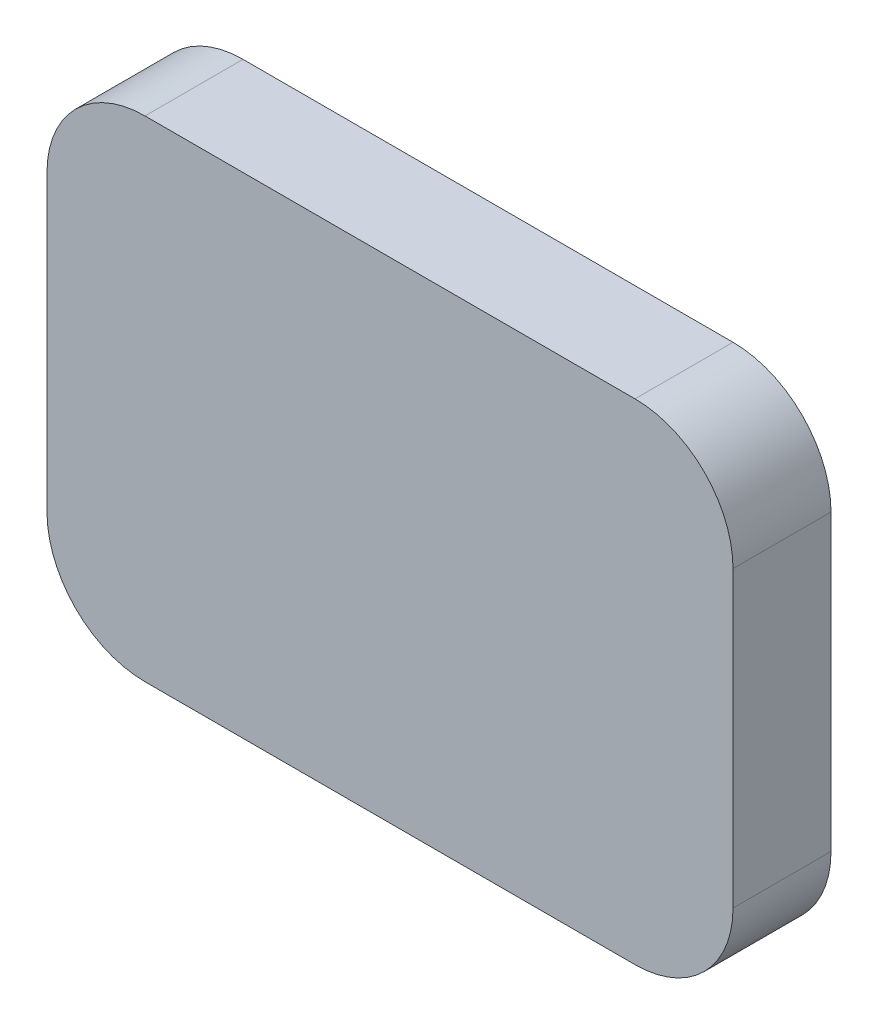
ISO-10303-21;
HEADER;
FILE_DESCRIPTION(('STEP AP214'),'2;1');
FILE_NAME('part.step','',(''),(''),'','','');
FILE_SCHEMA(('AUTOMOTIVE_DESIGN { 1 0 10303 214 1 1 1 1 }'));
ENDSEC;
DATA;
#1=APPLICATION_CONTEXT('core data for automotive mechanical design processes');
#2=APPLICATION_PROTOCOL_DEFINITION('international standard','automotive_design',2000,#1);
#3=PRODUCT_CONTEXT('',#1,'mechanical');
#4=PRODUCT('Part','Part','',(#3));
#5=PRODUCT_RELATED_PRODUCT_CATEGORY('part','',(#4));
#6=PRODUCT_DEFINITION_FORMATION('','',#4);
#7=PRODUCT_DEFINITION_CONTEXT('part definition',#1,'design');
#8=PRODUCT_DEFINITION('design','',#6,#7);
#9=PRODUCT_DEFINITION_SHAPE('','',#8);
#10=(LENGTH_UNIT() NAMED_UNIT(*) SI_UNIT(.MILLI.,.METRE.));
#11=(NAMED_UNIT(*) PLANE_ANGLE_UNIT() SI_UNIT($,.RADIAN.));
#12=(NAMED_UNIT(*) SI_UNIT($,.STERADIAN.) SOLID_ANGLE_UNIT());
#13=UNCERTAINTY_MEASURE_WITH_UNIT(LENGTH_MEASURE(1.E-05),#10,'distance_accuracy_value','');
#14=(GEOMETRIC_REPRESENTATION_CONTEXT(3) GLOBAL_UNCERTAINTY_ASSIGNED_CONTEXT((#13)) GLOBAL_UNIT_ASSIGNED_CONTEXT((#10,
#11,#12)) REPRESENTATION_CONTEXT('',''));
#15=CARTESIAN_POINT('',(0.,0.,0.));
#16=DIRECTION('',(0.,0.,1.));
#17=DIRECTION('',(1.,0.,0.));
#18=AXIS2_PLACEMENT_3D('',#15,#16,#17);
#19=CARTESIAN_POINT('',(0.,0.,10.));
#20=DIRECTION('',(1.,0.,0.));
#21=DIRECTION('',(0.,1.,0.));
#22=AXIS2_PLACEMENT_3D('',#19,#20,#21);
#23=PLANE('',#22);
#24=DIRECTION('',(0.,-1.,0.));
#25=VECTOR('',#24,1.);
#26=CARTESIAN_POINT('',(0.,0.,0.));
#27=LINE('',#26,#25);
#28=CARTESIAN_POINT('',(0.,-10.,0.));
#29=VERTEX_POINT('',#28);
#30=CARTESIAN_POINT('',(0.,-40.,0.));
#31=VERTEX_POINT('',#30);
#32=EDGE_CURVE('E128',#29,#31,#27,.T.);
#33=ORIENTED_EDGE('',*,*,#32,.T.);
#34=DIRECTION('',(0.,0.,-1.));
#35=VECTOR('',#34,1.);
#36=CARTESIAN_POINT('',(0.,-40.,10.));
#37=LINE('',#36,#35);
#38=CARTESIAN_POINT('',(0.,-40.,10.));
#39=VERTEX_POINT('',#38);
#40=EDGE_CURVE('E105',#31,#39,#37,.F.);
#41=ORIENTED_EDGE('',*,*,#40,.T.);
#42=DIRECTION('',(0.,-1.,0.));
#43=VECTOR('',#42,1.);
#44=CARTESIAN_POINT('',(0.,0.,10.));
#45=LINE('',#44,#43);
#46=CARTESIAN_POINT('',(0.,-10.,10.));
#47=VERTEX_POINT('',#46);
#48=EDGE_CURVE('E137',#47,#39,#45,.T.);
#49=ORIENTED_EDGE('',*,*,#48,.F.);
#50=DIRECTION('',(0.,0.,-1.));
#51=VECTOR('',#50,1.);
#52=CARTESIAN_POINT('',(0.,-10.,10.));
#53=LINE('',#52,#51);
#54=EDGE_CURVE('E110',#47,#29,#53,.T.);
#55=ORIENTED_EDGE('',*,*,#54,.T.);
#56=EDGE_LOOP('',(#33,#41,#49,#55));
#57=FACE_BOUND('',#56,.T.);
#58=ADVANCED_FACE('F33',(#57),#23,.F.);
#59=CARTESIAN_POINT('',(0.,-50.,10.));
#60=DIRECTION('',(0.,1.,0.));
#61=DIRECTION('',(0.,0.,1.));
#62=AXIS2_PLACEMENT_3D('',#59,#60,#61);
#63=PLANE('',#62);
#64=DIRECTION('',(1.,0.,0.));
#65=VECTOR('',#64,1.);
#66=CARTESIAN_POINT('',(0.,-50.,10.));
#67=LINE('',#66,#65);
#68=CARTESIAN_POINT('',(10.,-50.,10.));
#69=VERTEX_POINT('',#68);
#70=CARTESIAN_POINT('',(60.,-50.,10.));
#71=VERTEX_POINT('',#70);
#72=EDGE_CURVE('E120',#69,#71,#67,.T.);
#73=ORIENTED_EDGE('',*,*,#72,.F.);
#74=DIRECTION('',(0.,0.,-1.));
#75=VECTOR('',#74,1.);
#76=CARTESIAN_POINT('',(10.,-50.,10.));
#77=LINE('',#76,#75);
#78=CARTESIAN_POINT('',(10.,-50.,0.));
#79=VERTEX_POINT('',#78);
#80=EDGE_CURVE('E104',#69,#79,#77,.T.);
#81=ORIENTED_EDGE('',*,*,#80,.T.);
#82=DIRECTION('',(1.,0.,0.));
#83=VECTOR('',#82,1.);
#84=CARTESIAN_POINT('',(0.,-50.,0.));
#85=LINE('',#84,#83);
#86=CARTESIAN_POINT('',(60.,-50.,0.));
#87=VERTEX_POINT('',#86);
#88=EDGE_CURVE('E117',#79,#87,#85,.T.);
#89=ORIENTED_EDGE('',*,*,#88,.T.);
#90=DIRECTION('',(0.,0.,-1.));
#91=VECTOR('',#90,1.);
#92=CARTESIAN_POINT('',(60.,-50.,10.));
#93=LINE('',#92,#91);
#94=EDGE_CURVE('E122',#87,#71,#93,.F.);
#95=ORIENTED_EDGE('',*,*,#94,.T.);
#96=EDGE_LOOP('',(#73,#81,#89,#95));
#97=FACE_BOUND('',#96,.T.);
#98=ADVANCED_FACE('F116',(#97),#63,.F.);
#99=CARTESIAN_POINT('',(70.,0.,10.));
#100=DIRECTION('',(-1.,0.,0.));
#101=DIRECTION('',(0.,0.,1.));
#102=AXIS2_PLACEMENT_3D('',#99,#100,#101);
#103=PLANE('',#102);
#104=DIRECTION('',(0.,1.,0.));
#105=VECTOR('',#104,1.);
#106=CARTESIAN_POINT('',(70.,0.,10.));
#107=LINE('',#106,#105);
#108=CARTESIAN_POINT('',(70.,-40.,10.));
#109=VERTEX_POINT('',#108);
#110=CARTESIAN_POINT('',(70.,-10.,10.));
#111=VERTEX_POINT('',#110);
#112=EDGE_CURVE('E160',#109,#111,#107,.T.);
#113=ORIENTED_EDGE('',*,*,#112,.F.);
#114=DIRECTION('',(0.,0.,-1.));
#115=VECTOR('',#114,1.);
#116=CARTESIAN_POINT('',(70.,-40.,10.));
#117=LINE('',#116,#115);
#118=CARTESIAN_POINT('',(70.,-40.,0.));
#119=VERTEX_POINT('',#118);
#120=EDGE_CURVE('E11',#109,#119,#117,.T.);
#121=ORIENTED_EDGE('',*,*,#120,.T.);
#122=DIRECTION('',(0.,1.,0.));
#123=VECTOR('',#122,1.);
#124=CARTESIAN_POINT('',(70.,0.,0.));
#125=LINE('',#124,#123);
#126=CARTESIAN_POINT('',(70.,-10.,0.));
#127=VERTEX_POINT('',#126);
#128=EDGE_CURVE('E127',#119,#127,#125,.T.);
#129=ORIENTED_EDGE('',*,*,#128,.T.);
#130=DIRECTION('',(0.,0.,-1.));
#131=VECTOR('',#130,1.);
#132=CARTESIAN_POINT('',(70.,-10.,10.));
#133=LINE('',#132,#131);
#134=EDGE_CURVE('E41',#127,#111,#133,.F.);
#135=ORIENTED_EDGE('',*,*,#134,.T.);
#136=EDGE_LOOP('',(#113,#121,#129,#135));
#137=FACE_BOUND('',#136,.T.);
#138=ADVANCED_FACE('F159',(#137),#103,.F.);
#139=CARTESIAN_POINT('',(0.,0.,10.));
#140=DIRECTION('',(0.,-1.,0.));
#141=DIRECTION('',(0.,0.,-1.));
#142=AXIS2_PLACEMENT_3D('',#139,#140,#141);
#143=PLANE('',#142);
#144=DIRECTION('',(-1.,0.,0.));
#145=VECTOR('',#144,1.);
#146=CARTESIAN_POINT('',(0.,0.,0.));
#147=LINE('',#146,#145);
#148=CARTESIAN_POINT('',(60.,0.,0.));
#149=VERTEX_POINT('',#148);
#150=CARTESIAN_POINT('',(10.,0.,0.));
#151=VERTEX_POINT('',#150);
#152=EDGE_CURVE('E131',#149,#151,#147,.T.);
#153=ORIENTED_EDGE('',*,*,#152,.T.);
#154=DIRECTION('',(0.,0.,-1.));
#155=VECTOR('',#154,1.);
#156=CARTESIAN_POINT('',(10.,0.,10.));
#157=LINE('',#156,#155);
#158=CARTESIAN_POINT('',(10.,0.,10.));
#159=VERTEX_POINT('',#158);
#160=EDGE_CURVE('E48',#151,#159,#157,.F.);
#161=ORIENTED_EDGE('',*,*,#160,.T.);
#162=DIRECTION('',(-1.,0.,0.));
#163=VECTOR('',#162,1.);
#164=CARTESIAN_POINT('',(0.,0.,10.));
#165=LINE('',#164,#163);
#166=CARTESIAN_POINT('',(60.,0.,10.));
#167=VERTEX_POINT('',#166);
#168=EDGE_CURVE('E138',#167,#159,#165,.T.);
#169=ORIENTED_EDGE('',*,*,#168,.F.);
#170=DIRECTION('',(0.,0.,-1.));
#171=VECTOR('',#170,1.);
#172=CARTESIAN_POINT('',(60.,0.,10.));
#173=LINE('',#172,#171);
#174=EDGE_CURVE('E153',#167,#149,#173,.T.);
#175=ORIENTED_EDGE('',*,*,#174,.T.);
#176=EDGE_LOOP('',(#153,#161,#169,#175));
#177=FACE_BOUND('',#176,.T.);
#178=ADVANCED_FACE('F169',(#177),#143,.F.);
#179=CARTESIAN_POINT('',(0.,0.,10.));
#180=DIRECTION('',(0.,0.,1.));
#181=DIRECTION('',(1.,0.,0.));
#182=AXIS2_PLACEMENT_3D('',#179,#180,#181);
#183=PLANE('',#182);
#184=ORIENTED_EDGE('',*,*,#48,.T.);
#185=CARTESIAN_POINT('',(10.,-40.,10.));
#186=DIRECTION('',(0.,0.,1.));
#187=DIRECTION('',(1.,0.,0.));
#188=AXIS2_PLACEMENT_3D('',#185,#186,#187);
#189=CIRCLE('',#188,10.);
#190=EDGE_CURVE('E151',#39,#69,#189,.T.);
#191=ORIENTED_EDGE('',*,*,#190,.T.);
#192=ORIENTED_EDGE('',*,*,#72,.T.);
#193=CARTESIAN_POINT('',(60.,-40.,10.));
#194=DIRECTION('',(0.,0.,1.));
#195=DIRECTION('',(1.,0.,0.));
#196=AXIS2_PLACEMENT_3D('',#193,#194,#195);
#197=CIRCLE('',#196,10.);
#198=EDGE_CURVE('E147',#71,#109,#197,.T.);
#199=ORIENTED_EDGE('',*,*,#198,.T.);
#200=ORIENTED_EDGE('',*,*,#112,.T.);
#201=CARTESIAN_POINT('',(60.,-10.,10.));
#202=DIRECTION('',(0.,0.,1.));
#203=DIRECTION('',(1.,0.,0.));
#204=AXIS2_PLACEMENT_3D('',#201,#202,#203);
#205=CIRCLE('',#204,10.);
#206=EDGE_CURVE('E55',#111,#167,#205,.T.);
#207=ORIENTED_EDGE('',*,*,#206,.T.);
#208=ORIENTED_EDGE('',*,*,#168,.T.);
#209=CARTESIAN_POINT('',(10.,-10.,10.));
#210=DIRECTION('',(0.,0.,1.));
#211=DIRECTION('',(1.,0.,0.));
#212=AXIS2_PLACEMENT_3D('',#209,#210,#211);
#213=CIRCLE('',#212,10.);
#214=EDGE_CURVE('E149',#159,#47,#213,.T.);
#215=ORIENTED_EDGE('',*,*,#214,.T.);
#216=EDGE_LOOP('',(#184,#191,#192,#199,#200,#207,#208,#215));
#217=FACE_BOUND('',#216,.T.);
#218=ADVANCED_FACE('F164',(#217),#183,.T.);
#219=CARTESIAN_POINT('',(0.,0.,0.));
#220=DIRECTION('',(0.,0.,1.));
#221=DIRECTION('',(1.,0.,0.));
#222=AXIS2_PLACEMENT_3D('',#219,#220,#221);
#223=PLANE('',#222);
#224=ORIENTED_EDGE('',*,*,#88,.F.);
#225=CARTESIAN_POINT('',(10.,-40.,0.));
#226=DIRECTION('',(0.,0.,1.));
#227=DIRECTION('',(1.,0.,0.));
#228=AXIS2_PLACEMENT_3D('',#225,#226,#227);
#229=CIRCLE('',#228,10.);
#230=EDGE_CURVE('E100',#79,#31,#229,.F.);
#231=ORIENTED_EDGE('',*,*,#230,.T.);
#232=ORIENTED_EDGE('',*,*,#32,.F.);
#233=CARTESIAN_POINT('',(10.,-10.,0.));
#234=DIRECTION('',(0.,0.,1.));
#235=DIRECTION('',(1.,0.,0.));
#236=AXIS2_PLACEMENT_3D('',#233,#234,#235);
#237=CIRCLE('',#236,10.);
#238=EDGE_CURVE('E111',#29,#151,#237,.F.);
#239=ORIENTED_EDGE('',*,*,#238,.T.);
#240=ORIENTED_EDGE('',*,*,#152,.F.);
#241=CARTESIAN_POINT('',(60.,-10.,0.));
#242=DIRECTION('',(0.,0.,1.));
#243=DIRECTION('',(1.,0.,0.));
#244=AXIS2_PLACEMENT_3D('',#241,#242,#243);
#245=CIRCLE('',#244,10.);
#246=EDGE_CURVE('E121',#149,#127,#245,.F.);
#247=ORIENTED_EDGE('',*,*,#246,.T.);
#248=ORIENTED_EDGE('',*,*,#128,.F.);
#249=CARTESIAN_POINT('',(60.,-40.,0.));
#250=DIRECTION('',(0.,0.,1.));
#251=DIRECTION('',(1.,0.,0.));
#252=AXIS2_PLACEMENT_3D('',#249,#250,#251);
#253=CIRCLE('',#252,10.);
#254=EDGE_CURVE('E126',#119,#87,#253,.F.);
#255=ORIENTED_EDGE('',*,*,#254,.T.);
#256=EDGE_LOOP('',(#224,#231,#232,#239,#240,#247,#248,#255));
#257=FACE_BOUND('',#256,.T.);
#258=ADVANCED_FACE('F124',(#257),#223,.F.);
#259=CARTESIAN_POINT('',(10.,-40.,10.));
#260=DIRECTION('',(0.,0.,-1.));
#261=DIRECTION('',(-1.,0.,0.));
#262=AXIS2_PLACEMENT_3D('',#259,#260,#261);
#263=CYLINDRICAL_SURFACE('',#262,10.);
#264=ORIENTED_EDGE('',*,*,#190,.F.);
#265=ORIENTED_EDGE('',*,*,#40,.F.);
#266=ORIENTED_EDGE('',*,*,#230,.F.);
#267=ORIENTED_EDGE('',*,*,#80,.F.);
#268=EDGE_LOOP('',(#264,#265,#266,#267));
#269=FACE_BOUND('',#268,.T.);
#270=ADVANCED_FACE('F103',(#269),#263,.T.);
#271=CARTESIAN_POINT('',(10.,-10.,10.));
#272=DIRECTION('',(0.,0.,-1.));
#273=DIRECTION('',(-1.,0.,0.));
#274=AXIS2_PLACEMENT_3D('',#271,#272,#273);
#275=CYLINDRICAL_SURFACE('',#274,10.);
#276=ORIENTED_EDGE('',*,*,#214,.F.);
#277=ORIENTED_EDGE('',*,*,#160,.F.);
#278=ORIENTED_EDGE('',*,*,#238,.F.);
#279=ORIENTED_EDGE('',*,*,#54,.F.);
#280=EDGE_LOOP('',(#276,#277,#278,#279));
#281=FACE_BOUND('',#280,.T.);
#282=ADVANCED_FACE('F173',(#281),#275,.T.);
#283=CARTESIAN_POINT('',(60.,-40.,10.));
#284=DIRECTION('',(0.,0.,-1.));
#285=DIRECTION('',(-1.,0.,0.));
#286=AXIS2_PLACEMENT_3D('',#283,#284,#285);
#287=CYLINDRICAL_SURFACE('',#286,10.);
#288=ORIENTED_EDGE('',*,*,#198,.F.);
#289=ORIENTED_EDGE('',*,*,#94,.F.);
#290=ORIENTED_EDGE('',*,*,#254,.F.);
#291=ORIENTED_EDGE('',*,*,#120,.F.);
#292=EDGE_LOOP('',(#288,#289,#290,#291));
#293=FACE_BOUND('',#292,.T.);
#294=ADVANCED_FACE('F179',(#293),#287,.T.);
#295=CARTESIAN_POINT('',(60.,-10.,10.));
#296=DIRECTION('',(0.,0.,-1.));
#297=DIRECTION('',(-1.,0.,0.));
#298=AXIS2_PLACEMENT_3D('',#295,#296,#297);
#299=CYLINDRICAL_SURFACE('',#298,10.);
#300=ORIENTED_EDGE('',*,*,#206,.F.);
#301=ORIENTED_EDGE('',*,*,#134,.F.);
#302=ORIENTED_EDGE('',*,*,#246,.F.);
#303=ORIENTED_EDGE('',*,*,#174,.F.);
#304=EDGE_LOOP('',(#300,#301,#302,#303));
#305=FACE_BOUND('',#304,.T.);
#306=ADVANCED_FACE('F35',(#305),#299,.T.);
#307=CLOSED_SHELL('',(#58,#98,#138,#178,#218,#258,#270,#282,#294,#306));
#308=MANIFOLD_SOLID_BREP('B2',#307);
#309=ADVANCED_BREP_SHAPE_REPRESENTATION('',(#18,#308),#14);
#310=SHAPE_DEFINITION_REPRESENTATION(#9,#309);
ENDSEC;
END-ISO-10303-21;
